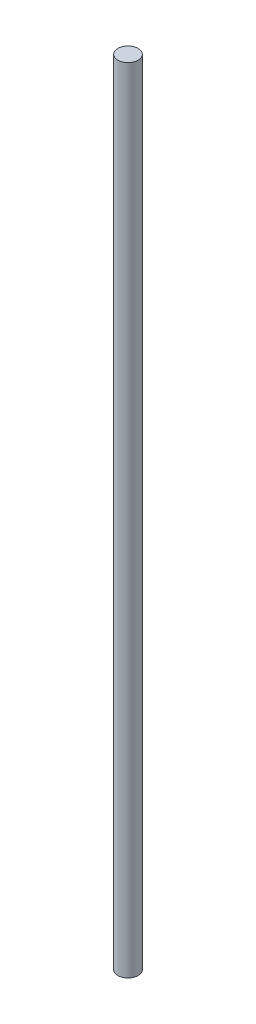
ISO-10303-21;
HEADER;
FILE_DESCRIPTION(('STEP AP214'),'2;1');
FILE_NAME('part.step','',(''),(''),'','','');
FILE_SCHEMA(('AUTOMOTIVE_DESIGN { 1 0 10303 214 1 1 1 1 }'));
ENDSEC;
DATA;
#1=APPLICATION_CONTEXT('core data for automotive mechanical design processes');
#2=APPLICATION_PROTOCOL_DEFINITION('international standard','automotive_design',2000,#1);
#3=PRODUCT_CONTEXT('',#1,'mechanical');
#4=PRODUCT('Part','Part','',(#3));
#5=PRODUCT_RELATED_PRODUCT_CATEGORY('part','',(#4));
#6=PRODUCT_DEFINITION_FORMATION('','',#4);
#7=PRODUCT_DEFINITION_CONTEXT('part definition',#1,'design');
#8=PRODUCT_DEFINITION('design','',#6,#7);
#9=PRODUCT_DEFINITION_SHAPE('','',#8);
#10=(LENGTH_UNIT() NAMED_UNIT(*) SI_UNIT(.MILLI.,.METRE.));
#11=(NAMED_UNIT(*) PLANE_ANGLE_UNIT() SI_UNIT($,.RADIAN.));
#12=(NAMED_UNIT(*) SI_UNIT($,.STERADIAN.) SOLID_ANGLE_UNIT());
#13=UNCERTAINTY_MEASURE_WITH_UNIT(LENGTH_MEASURE(1.E-05),#10,'distance_accuracy_value','');
#14=(GEOMETRIC_REPRESENTATION_CONTEXT(3) GLOBAL_UNCERTAINTY_ASSIGNED_CONTEXT((#13)) GLOBAL_UNIT_ASSIGNED_CONTEXT((#10,
#11,#12)) REPRESENTATION_CONTEXT('',''));
#15=CARTESIAN_POINT('',(0.,0.,0.));
#16=DIRECTION('',(0.,0.,1.));
#17=DIRECTION('',(1.,0.,0.));
#18=AXIS2_PLACEMENT_3D('',#15,#16,#17);
#19=CARTESIAN_POINT('',(0.,247.65,0.));
#20=DIRECTION('',(0.,-1.,0.));
#21=DIRECTION('',(0.,0.,-1.));
#22=AXIS2_PLACEMENT_3D('',#19,#20,#21);
#23=CYLINDRICAL_SURFACE('',#22,3.175);
#24=CARTESIAN_POINT('',(0.,247.65,0.));
#25=DIRECTION('',(0.,1.,0.));
#26=DIRECTION('',(0.,0.,1.));
#27=AXIS2_PLACEMENT_3D('',#24,#25,#26);
#28=CIRCLE('',#27,3.175);
#29=CARTESIAN_POINT('',(0.,247.65,3.175));
#30=VERTEX_POINT('',#29);
#31=EDGE_CURVE('E10',#30,#30,#28,.T.);
#32=ORIENTED_EDGE('',*,*,#31,.F.);
#33=EDGE_LOOP('',(#32));
#34=FACE_BOUND('',#33,.T.);
#35=CARTESIAN_POINT('',(0.,0.,0.));
#36=DIRECTION('',(0.,1.,0.));
#37=DIRECTION('',(0.,0.,1.));
#38=AXIS2_PLACEMENT_3D('',#35,#36,#37);
#39=CIRCLE('',#38,3.175);
#40=CARTESIAN_POINT('',(0.,0.,3.175));
#41=VERTEX_POINT('',#40);
#42=EDGE_CURVE('E34',#41,#41,#39,.T.);
#43=ORIENTED_EDGE('',*,*,#42,.T.);
#44=EDGE_LOOP('',(#43));
#45=FACE_BOUND('',#44,.T.);
#46=ADVANCED_FACE('F31',(#34,#45),#23,.T.);
#47=CARTESIAN_POINT('',(0.,247.65,0.));
#48=DIRECTION('',(0.,1.,0.));
#49=DIRECTION('',(0.,0.,1.));
#50=AXIS2_PLACEMENT_3D('',#47,#48,#49);
#51=PLANE('',#50);
#52=ORIENTED_EDGE('',*,*,#31,.T.);
#53=EDGE_LOOP('',(#52));
#54=FACE_BOUND('',#53,.T.);
#55=ADVANCED_FACE('F46',(#54),#51,.T.);
#56=CARTESIAN_POINT('',(0.,0.,0.));
#57=DIRECTION('',(0.,1.,0.));
#58=DIRECTION('',(0.,0.,1.));
#59=AXIS2_PLACEMENT_3D('',#56,#57,#58);
#60=PLANE('',#59);
#61=ORIENTED_EDGE('',*,*,#42,.F.);
#62=EDGE_LOOP('',(#61));
#63=FACE_BOUND('',#62,.T.);
#64=ADVANCED_FACE('F44',(#63),#60,.F.);
#65=CLOSED_SHELL('',(#46,#55,#64));
#66=MANIFOLD_SOLID_BREP('B2',#65);
#67=ADVANCED_BREP_SHAPE_REPRESENTATION('',(#18,#66),#14);
#68=SHAPE_DEFINITION_REPRESENTATION(#9,#67);
ENDSEC;
END-ISO-10303-21;
